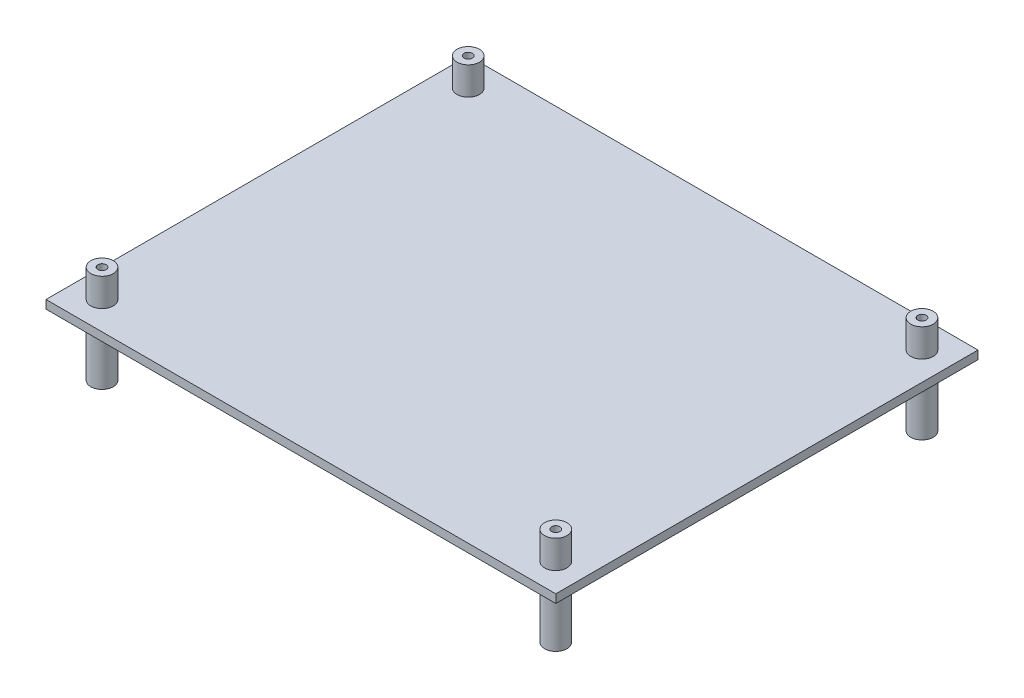
ISO-10303-21;
HEADER;
FILE_DESCRIPTION(('STEP AP214'),'2;1');
FILE_NAME('part.step','',(''),(''),'','','');
FILE_SCHEMA(('AUTOMOTIVE_DESIGN { 1 0 10303 214 1 1 1 1 }'));
ENDSEC;
DATA;
#1=APPLICATION_CONTEXT('core data for automotive mechanical design processes');
#2=APPLICATION_PROTOCOL_DEFINITION('international standard','automotive_design',2000,#1);
#3=PRODUCT_CONTEXT('',#1,'mechanical');
#4=PRODUCT('Part','Part','',(#3));
#5=PRODUCT_RELATED_PRODUCT_CATEGORY('part','',(#4));
#6=PRODUCT_DEFINITION_FORMATION('','',#4);
#7=PRODUCT_DEFINITION_CONTEXT('part definition',#1,'design');
#8=PRODUCT_DEFINITION('design','',#6,#7);
#9=PRODUCT_DEFINITION_SHAPE('','',#8);
#10=(LENGTH_UNIT() NAMED_UNIT(*) SI_UNIT(.MILLI.,.METRE.));
#11=(NAMED_UNIT(*) PLANE_ANGLE_UNIT() SI_UNIT($,.RADIAN.));
#12=(NAMED_UNIT(*) SI_UNIT($,.STERADIAN.) SOLID_ANGLE_UNIT());
#13=UNCERTAINTY_MEASURE_WITH_UNIT(LENGTH_MEASURE(1.E-05),#10,'distance_accuracy_value','');
#14=(GEOMETRIC_REPRESENTATION_CONTEXT(3) GLOBAL_UNCERTAINTY_ASSIGNED_CONTEXT((#13)) GLOBAL_UNIT_ASSIGNED_CONTEXT((#10,
#11,#12)) REPRESENTATION_CONTEXT('',''));
#15=CARTESIAN_POINT('',(0.,0.,0.));
#16=DIRECTION('',(0.,0.,1.));
#17=DIRECTION('',(1.,0.,0.));
#18=AXIS2_PLACEMENT_3D('',#15,#16,#17);
#19=CARTESIAN_POINT('',(0.,3.,0.));
#20=DIRECTION('',(0.,1.,0.));
#21=DIRECTION('',(0.,0.,1.));
#22=AXIS2_PLACEMENT_3D('',#19,#20,#21);
#23=PLANE('',#22);
#24=CARTESIAN_POINT('',(0.,3.,0.));
#25=DIRECTION('',(0.,1.,0.));
#26=DIRECTION('',(0.,0.,1.));
#27=AXIS2_PLACEMENT_3D('',#24,#25,#26);
#28=CIRCLE('',#27,4.);
#29=CARTESIAN_POINT('',(0.,3.,4.));
#30=VERTEX_POINT('',#29);
#31=EDGE_CURVE('E11',#30,#30,#28,.T.);
#32=ORIENTED_EDGE('',*,*,#31,.F.);
#33=EDGE_LOOP('',(#32));
#34=FACE_BOUND('',#33,.T.);
#35=CARTESIAN_POINT('',(162.,3.,0.));
#36=DIRECTION('',(0.,1.,0.));
#37=DIRECTION('',(0.,0.,1.));
#38=AXIS2_PLACEMENT_3D('',#35,#36,#37);
#39=CIRCLE('',#38,3.99999999999999);
#40=CARTESIAN_POINT('',(162.,3.,3.99999999999999));
#41=VERTEX_POINT('',#40);
#42=EDGE_CURVE('E49',#41,#41,#39,.T.);
#43=ORIENTED_EDGE('',*,*,#42,.F.);
#44=EDGE_LOOP('',(#43));
#45=FACE_BOUND('',#44,.T.);
#46=CARTESIAN_POINT('',(162.,3.,-130.75023901));
#47=DIRECTION('',(0.,1.,0.));
#48=DIRECTION('',(0.,0.,1.));
#49=AXIS2_PLACEMENT_3D('',#46,#47,#48);
#50=CIRCLE('',#49,3.99999999999999);
#51=CARTESIAN_POINT('',(162.,3.,-126.75023901));
#52=VERTEX_POINT('',#51);
#53=EDGE_CURVE('E186',#52,#52,#50,.T.);
#54=ORIENTED_EDGE('',*,*,#53,.F.);
#55=EDGE_LOOP('',(#54));
#56=FACE_BOUND('',#55,.T.);
#57=CARTESIAN_POINT('',(0.,3.,-130.75023901));
#58=DIRECTION('',(0.,1.,0.));
#59=DIRECTION('',(0.,0.,1.));
#60=AXIS2_PLACEMENT_3D('',#57,#58,#59);
#61=CIRCLE('',#60,4.);
#62=CARTESIAN_POINT('',(0.,3.,-126.75023901));
#63=VERTEX_POINT('',#62);
#64=EDGE_CURVE('E117',#63,#63,#61,.T.);
#65=ORIENTED_EDGE('',*,*,#64,.F.);
#66=EDGE_LOOP('',(#65));
#67=FACE_BOUND('',#66,.T.);
#68=DIRECTION('',(1.,0.,0.));
#69=VECTOR('',#68,1.);
#70=CARTESIAN_POINT('',(-10.,3.,10.));
#71=LINE('',#70,#69);
#72=CARTESIAN_POINT('',(-10.,3.,10.));
#73=VERTEX_POINT('',#72);
#74=CARTESIAN_POINT('',(172.,3.,10.));
#75=VERTEX_POINT('',#74);
#76=EDGE_CURVE('E93',#73,#75,#71,.T.);
#77=ORIENTED_EDGE('',*,*,#76,.T.);
#78=DIRECTION('',(0.,0.,-1.));
#79=VECTOR('',#78,1.);
#80=CARTESIAN_POINT('',(172.,3.,10.));
#81=LINE('',#80,#79);
#82=CARTESIAN_POINT('',(172.,3.,-140.75023901));
#83=VERTEX_POINT('',#82);
#84=EDGE_CURVE('E89',#75,#83,#81,.T.);
#85=ORIENTED_EDGE('',*,*,#84,.T.);
#86=DIRECTION('',(-1.,0.,0.));
#87=VECTOR('',#86,1.);
#88=CARTESIAN_POINT('',(-10.,3.,-140.75023901));
#89=LINE('',#88,#87);
#90=CARTESIAN_POINT('',(-10.,3.,-140.75023901));
#91=VERTEX_POINT('',#90);
#92=EDGE_CURVE('E91',#83,#91,#89,.T.);
#93=ORIENTED_EDGE('',*,*,#92,.T.);
#94=DIRECTION('',(0.,0.,1.));
#95=VECTOR('',#94,1.);
#96=CARTESIAN_POINT('',(-10.,3.,10.));
#97=LINE('',#96,#95);
#98=EDGE_CURVE('E58',#91,#73,#97,.T.);
#99=ORIENTED_EDGE('',*,*,#98,.T.);
#100=EDGE_LOOP('',(#77,#85,#93,#99));
#101=FACE_BOUND('',#100,.T.);
#102=ADVANCED_FACE('F39',(#34,#45,#56,#67,#101),#23,.T.);
#103=CARTESIAN_POINT('',(0.,0.,0.));
#104=DIRECTION('',(0.,1.,0.));
#105=DIRECTION('',(0.,0.,1.));
#106=AXIS2_PLACEMENT_3D('',#103,#104,#105);
#107=PLANE('',#106);
#108=CARTESIAN_POINT('',(0.,0.,0.));
#109=DIRECTION('',(0.,1.,0.));
#110=DIRECTION('',(0.,0.,1.));
#111=AXIS2_PLACEMENT_3D('',#108,#109,#110);
#112=CIRCLE('',#111,4.);
#113=CARTESIAN_POINT('',(0.,0.,4.));
#114=VERTEX_POINT('',#113);
#115=EDGE_CURVE('E43',#114,#114,#112,.T.);
#116=ORIENTED_EDGE('',*,*,#115,.T.);
#117=EDGE_LOOP('',(#116));
#118=FACE_BOUND('',#117,.T.);
#119=CARTESIAN_POINT('',(162.,0.,0.));
#120=DIRECTION('',(0.,1.,0.));
#121=DIRECTION('',(0.,0.,1.));
#122=AXIS2_PLACEMENT_3D('',#119,#120,#121);
#123=CIRCLE('',#122,3.99999999999999);
#124=CARTESIAN_POINT('',(162.,0.,3.99999999999999));
#125=VERTEX_POINT('',#124);
#126=EDGE_CURVE('E124',#125,#125,#123,.T.);
#127=ORIENTED_EDGE('',*,*,#126,.T.);
#128=EDGE_LOOP('',(#127));
#129=FACE_BOUND('',#128,.T.);
#130=CARTESIAN_POINT('',(162.,0.,-130.75023901));
#131=DIRECTION('',(0.,1.,0.));
#132=DIRECTION('',(0.,0.,1.));
#133=AXIS2_PLACEMENT_3D('',#130,#131,#132);
#134=CIRCLE('',#133,3.99999999999999);
#135=CARTESIAN_POINT('',(162.,0.,-126.75023901));
#136=VERTEX_POINT('',#135);
#137=EDGE_CURVE('E121',#136,#136,#134,.T.);
#138=ORIENTED_EDGE('',*,*,#137,.T.);
#139=EDGE_LOOP('',(#138));
#140=FACE_BOUND('',#139,.T.);
#141=CARTESIAN_POINT('',(0.,0.,-130.75023901));
#142=DIRECTION('',(0.,1.,0.));
#143=DIRECTION('',(0.,0.,1.));
#144=AXIS2_PLACEMENT_3D('',#141,#142,#143);
#145=CIRCLE('',#144,4.);
#146=CARTESIAN_POINT('',(0.,0.,-126.75023901));
#147=VERTEX_POINT('',#146);
#148=EDGE_CURVE('E118',#147,#147,#145,.T.);
#149=ORIENTED_EDGE('',*,*,#148,.T.);
#150=EDGE_LOOP('',(#149));
#151=FACE_BOUND('',#150,.T.);
#152=DIRECTION('',(1.,0.,0.));
#153=VECTOR('',#152,1.);
#154=CARTESIAN_POINT('',(-10.,0.,10.));
#155=LINE('',#154,#153);
#156=CARTESIAN_POINT('',(-10.,0.,10.));
#157=VERTEX_POINT('',#156);
#158=CARTESIAN_POINT('',(172.,0.,10.));
#159=VERTEX_POINT('',#158);
#160=EDGE_CURVE('E108',#157,#159,#155,.T.);
#161=ORIENTED_EDGE('',*,*,#160,.F.);
#162=DIRECTION('',(0.,0.,1.));
#163=VECTOR('',#162,1.);
#164=CARTESIAN_POINT('',(-10.,0.,10.));
#165=LINE('',#164,#163);
#166=CARTESIAN_POINT('',(-10.,0.,-140.75023901));
#167=VERTEX_POINT('',#166);
#168=EDGE_CURVE('E81',#167,#157,#165,.T.);
#169=ORIENTED_EDGE('',*,*,#168,.F.);
#170=DIRECTION('',(-1.,0.,0.));
#171=VECTOR('',#170,1.);
#172=CARTESIAN_POINT('',(-10.,0.,-140.75023901));
#173=LINE('',#172,#171);
#174=CARTESIAN_POINT('',(172.,0.,-140.75023901));
#175=VERTEX_POINT('',#174);
#176=EDGE_CURVE('E75',#175,#167,#173,.T.);
#177=ORIENTED_EDGE('',*,*,#176,.F.);
#178=DIRECTION('',(0.,0.,-1.));
#179=VECTOR('',#178,1.);
#180=CARTESIAN_POINT('',(172.,0.,10.));
#181=LINE('',#180,#179);
#182=EDGE_CURVE('E98',#159,#175,#181,.T.);
#183=ORIENTED_EDGE('',*,*,#182,.F.);
#184=EDGE_LOOP('',(#161,#169,#177,#183));
#185=FACE_BOUND('',#184,.T.);
#186=ADVANCED_FACE('F131',(#118,#129,#140,#151,#185),#107,.F.);
#187=CARTESIAN_POINT('',(-10.,3.,10.));
#188=DIRECTION('',(0.,0.,-1.));
#189=DIRECTION('',(-1.,0.,0.));
#190=AXIS2_PLACEMENT_3D('',#187,#188,#189);
#191=PLANE('',#190);
#192=ORIENTED_EDGE('',*,*,#160,.T.);
#193=DIRECTION('',(0.,-1.,0.));
#194=VECTOR('',#193,1.);
#195=CARTESIAN_POINT('',(172.,3.,10.));
#196=LINE('',#195,#194);
#197=EDGE_CURVE('E99',#75,#159,#196,.T.);
#198=ORIENTED_EDGE('',*,*,#197,.F.);
#199=ORIENTED_EDGE('',*,*,#76,.F.);
#200=DIRECTION('',(0.,-1.,0.));
#201=VECTOR('',#200,1.);
#202=CARTESIAN_POINT('',(-10.,3.,10.));
#203=LINE('',#202,#201);
#204=EDGE_CURVE('E104',#73,#157,#203,.T.);
#205=ORIENTED_EDGE('',*,*,#204,.T.);
#206=EDGE_LOOP('',(#192,#198,#199,#205));
#207=FACE_BOUND('',#206,.T.);
#208=ADVANCED_FACE('F41',(#207),#191,.F.);
#209=CARTESIAN_POINT('',(172.,3.,10.));
#210=DIRECTION('',(-1.,0.,0.));
#211=DIRECTION('',(0.,0.,1.));
#212=AXIS2_PLACEMENT_3D('',#209,#210,#211);
#213=PLANE('',#212);
#214=ORIENTED_EDGE('',*,*,#182,.T.);
#215=DIRECTION('',(0.,-1.,0.));
#216=VECTOR('',#215,1.);
#217=CARTESIAN_POINT('',(172.,3.,-140.75023901));
#218=LINE('',#217,#216);
#219=EDGE_CURVE('E96',#83,#175,#218,.T.);
#220=ORIENTED_EDGE('',*,*,#219,.F.);
#221=ORIENTED_EDGE('',*,*,#84,.F.);
#222=ORIENTED_EDGE('',*,*,#197,.T.);
#223=EDGE_LOOP('',(#214,#220,#221,#222));
#224=FACE_BOUND('',#223,.T.);
#225=ADVANCED_FACE('F97',(#224),#213,.F.);
#226=CARTESIAN_POINT('',(-10.,3.,-140.75023901));
#227=DIRECTION('',(0.,0.,1.));
#228=DIRECTION('',(1.,0.,0.));
#229=AXIS2_PLACEMENT_3D('',#226,#227,#228);
#230=PLANE('',#229);
#231=ORIENTED_EDGE('',*,*,#176,.T.);
#232=DIRECTION('',(0.,-1.,0.));
#233=VECTOR('',#232,1.);
#234=CARTESIAN_POINT('',(-10.,3.,-140.75023901));
#235=LINE('',#234,#233);
#236=EDGE_CURVE('E100',#91,#167,#235,.T.);
#237=ORIENTED_EDGE('',*,*,#236,.F.);
#238=ORIENTED_EDGE('',*,*,#92,.F.);
#239=ORIENTED_EDGE('',*,*,#219,.T.);
#240=EDGE_LOOP('',(#231,#237,#238,#239));
#241=FACE_BOUND('',#240,.T.);
#242=ADVANCED_FACE('F102',(#241),#230,.F.);
#243=CARTESIAN_POINT('',(-10.,3.,10.));
#244=DIRECTION('',(1.,0.,0.));
#245=DIRECTION('',(0.,0.,-1.));
#246=AXIS2_PLACEMENT_3D('',#243,#244,#245);
#247=PLANE('',#246);
#248=ORIENTED_EDGE('',*,*,#168,.T.);
#249=ORIENTED_EDGE('',*,*,#204,.F.);
#250=ORIENTED_EDGE('',*,*,#98,.F.);
#251=ORIENTED_EDGE('',*,*,#236,.T.);
#252=EDGE_LOOP('',(#248,#249,#250,#251));
#253=FACE_BOUND('',#252,.T.);
#254=ADVANCED_FACE('F170',(#253),#247,.F.);
#255=CARTESIAN_POINT('',(0.,-22.,-130.75023901));
#256=DIRECTION('',(0.,1.,0.));
#257=DIRECTION('',(0.,0.,1.));
#258=AXIS2_PLACEMENT_3D('',#255,#256,#257);
#259=CYLINDRICAL_SURFACE('',#258,4.);
#260=CARTESIAN_POINT('',(0.,-22.,-130.75023901));
#261=DIRECTION('',(0.,1.,0.));
#262=DIRECTION('',(0.,0.,1.));
#263=AXIS2_PLACEMENT_3D('',#260,#261,#262);
#264=CIRCLE('',#263,4.);
#265=CARTESIAN_POINT('',(0.,-22.,-126.75023901));
#266=VERTEX_POINT('',#265);
#267=EDGE_CURVE('E122',#266,#266,#264,.T.);
#268=ORIENTED_EDGE('',*,*,#267,.T.);
#269=EDGE_LOOP('',(#268));
#270=FACE_BOUND('',#269,.T.);
#271=ORIENTED_EDGE('',*,*,#148,.F.);
#272=EDGE_LOOP('',(#271));
#273=FACE_BOUND('',#272,.T.);
#274=ADVANCED_FACE('F172',(#270,#273),#259,.T.);
#275=CARTESIAN_POINT('',(0.,-22.,-130.75023901));
#276=DIRECTION('',(0.,1.,0.));
#277=DIRECTION('',(0.,0.,1.));
#278=AXIS2_PLACEMENT_3D('',#275,#276,#277);
#279=PLANE('',#278);
#280=CARTESIAN_POINT('',(0.,-22.,-130.75023901));
#281=DIRECTION('',(0.,1.,0.));
#282=DIRECTION('',(0.,0.,1.));
#283=AXIS2_PLACEMENT_3D('',#280,#281,#282);
#284=CIRCLE('',#283,1.5);
#285=CARTESIAN_POINT('',(0.,-22.,-129.25023901));
#286=VERTEX_POINT('',#285);
#287=EDGE_CURVE('E193',#286,#286,#284,.T.);
#288=ORIENTED_EDGE('',*,*,#287,.T.);
#289=EDGE_LOOP('',(#288));
#290=FACE_BOUND('',#289,.T.);
#291=ORIENTED_EDGE('',*,*,#267,.F.);
#292=EDGE_LOOP('',(#291));
#293=FACE_BOUND('',#292,.T.);
#294=ADVANCED_FACE('F364',(#290,#293),#279,.F.);
#295=CARTESIAN_POINT('',(0.,3.,-130.75023901));
#296=DIRECTION('',(0.,-1.,0.));
#297=DIRECTION('',(0.,0.,-1.));
#298=AXIS2_PLACEMENT_3D('',#295,#296,#297);
#299=CYLINDRICAL_SURFACE('',#298,1.5);
#300=ORIENTED_EDGE('',*,*,#287,.F.);
#301=EDGE_LOOP('',(#300));
#302=FACE_BOUND('',#301,.T.);
#303=CARTESIAN_POINT('',(0.,13.,-130.75023901));
#304=DIRECTION('',(0.,1.,0.));
#305=DIRECTION('',(0.,0.,1.));
#306=AXIS2_PLACEMENT_3D('',#303,#304,#305);
#307=CIRCLE('',#306,1.5);
#308=CARTESIAN_POINT('',(0.,13.,-129.25023901));
#309=VERTEX_POINT('',#308);
#310=EDGE_CURVE('E199',#309,#309,#307,.T.);
#311=ORIENTED_EDGE('',*,*,#310,.T.);
#312=EDGE_LOOP('',(#311));
#313=FACE_BOUND('',#312,.T.);
#314=ADVANCED_FACE('F167',(#302,#313),#299,.F.);
#315=CARTESIAN_POINT('',(162.,-22.,-130.75023901));
#316=DIRECTION('',(0.,1.,0.));
#317=DIRECTION('',(0.,0.,1.));
#318=AXIS2_PLACEMENT_3D('',#315,#316,#317);
#319=CYLINDRICAL_SURFACE('',#318,3.99999999999999);
#320=CARTESIAN_POINT('',(162.,-22.,-130.75023901));
#321=DIRECTION('',(0.,1.,0.));
#322=DIRECTION('',(0.,0.,1.));
#323=AXIS2_PLACEMENT_3D('',#320,#321,#322);
#324=CIRCLE('',#323,3.99999999999999);
#325=CARTESIAN_POINT('',(162.,-22.,-126.75023901));
#326=VERTEX_POINT('',#325);
#327=EDGE_CURVE('E218',#326,#326,#324,.T.);
#328=ORIENTED_EDGE('',*,*,#327,.T.);
#329=EDGE_LOOP('',(#328));
#330=FACE_BOUND('',#329,.T.);
#331=ORIENTED_EDGE('',*,*,#137,.F.);
#332=EDGE_LOOP('',(#331));
#333=FACE_BOUND('',#332,.T.);
#334=ADVANCED_FACE('F238',(#330,#333),#319,.T.);
#335=CARTESIAN_POINT('',(162.,-22.,-130.75023901));
#336=DIRECTION('',(0.,1.,0.));
#337=DIRECTION('',(0.,0.,1.));
#338=AXIS2_PLACEMENT_3D('',#335,#336,#337);
#339=PLANE('',#338);
#340=CARTESIAN_POINT('',(162.,-22.,-130.75023901));
#341=DIRECTION('',(0.,1.,0.));
#342=DIRECTION('',(0.,0.,1.));
#343=AXIS2_PLACEMENT_3D('',#340,#341,#342);
#344=CIRCLE('',#343,1.5);
#345=CARTESIAN_POINT('',(162.,-22.,-129.25023901));
#346=VERTEX_POINT('',#345);
#347=EDGE_CURVE('E232',#346,#346,#344,.T.);
#348=ORIENTED_EDGE('',*,*,#347,.T.);
#349=EDGE_LOOP('',(#348));
#350=FACE_BOUND('',#349,.T.);
#351=ORIENTED_EDGE('',*,*,#327,.F.);
#352=EDGE_LOOP('',(#351));
#353=FACE_BOUND('',#352,.T.);
#354=ADVANCED_FACE('F241',(#350,#353),#339,.F.);
#355=CARTESIAN_POINT('',(162.,3.,-130.75023901));
#356=DIRECTION('',(0.,-1.,0.));
#357=DIRECTION('',(0.,0.,-1.));
#358=AXIS2_PLACEMENT_3D('',#355,#356,#357);
#359=CYLINDRICAL_SURFACE('',#358,1.5);
#360=ORIENTED_EDGE('',*,*,#347,.F.);
#361=EDGE_LOOP('',(#360));
#362=FACE_BOUND('',#361,.T.);
#363=CARTESIAN_POINT('',(162.,13.,-130.75023901));
#364=DIRECTION('',(0.,1.,0.));
#365=DIRECTION('',(0.,0.,1.));
#366=AXIS2_PLACEMENT_3D('',#363,#364,#365);
#367=CIRCLE('',#366,1.5);
#368=CARTESIAN_POINT('',(162.,13.,-129.25023901));
#369=VERTEX_POINT('',#368);
#370=EDGE_CURVE('E202',#369,#369,#367,.T.);
#371=ORIENTED_EDGE('',*,*,#370,.T.);
#372=EDGE_LOOP('',(#371));
#373=FACE_BOUND('',#372,.T.);
#374=ADVANCED_FACE('F243',(#362,#373),#359,.F.);
#375=CARTESIAN_POINT('',(162.,-22.,0.));
#376=DIRECTION('',(0.,1.,0.));
#377=DIRECTION('',(0.,0.,1.));
#378=AXIS2_PLACEMENT_3D('',#375,#376,#377);
#379=CYLINDRICAL_SURFACE('',#378,3.99999999999999);
#380=CARTESIAN_POINT('',(162.,-22.,0.));
#381=DIRECTION('',(0.,1.,0.));
#382=DIRECTION('',(0.,0.,1.));
#383=AXIS2_PLACEMENT_3D('',#380,#381,#382);
#384=CIRCLE('',#383,3.99999999999999);
#385=CARTESIAN_POINT('',(162.,-22.,3.99999999999999));
#386=VERTEX_POINT('',#385);
#387=EDGE_CURVE('E206',#386,#386,#384,.T.);
#388=ORIENTED_EDGE('',*,*,#387,.T.);
#389=EDGE_LOOP('',(#388));
#390=FACE_BOUND('',#389,.T.);
#391=ORIENTED_EDGE('',*,*,#126,.F.);
#392=EDGE_LOOP('',(#391));
#393=FACE_BOUND('',#392,.T.);
#394=ADVANCED_FACE('F250',(#390,#393),#379,.T.);
#395=CARTESIAN_POINT('',(162.,-22.,0.));
#396=DIRECTION('',(0.,1.,0.));
#397=DIRECTION('',(0.,0.,1.));
#398=AXIS2_PLACEMENT_3D('',#395,#396,#397);
#399=PLANE('',#398);
#400=CARTESIAN_POINT('',(162.,-22.,0.));
#401=DIRECTION('',(0.,1.,0.));
#402=DIRECTION('',(0.,0.,1.));
#403=AXIS2_PLACEMENT_3D('',#400,#401,#402);
#404=CIRCLE('',#403,1.5);
#405=CARTESIAN_POINT('',(162.,-22.,1.5));
#406=VERTEX_POINT('',#405);
#407=EDGE_CURVE('E222',#406,#406,#404,.T.);
#408=ORIENTED_EDGE('',*,*,#407,.T.);
#409=EDGE_LOOP('',(#408));
#410=FACE_BOUND('',#409,.T.);
#411=ORIENTED_EDGE('',*,*,#387,.F.);
#412=EDGE_LOOP('',(#411));
#413=FACE_BOUND('',#412,.T.);
#414=ADVANCED_FACE('F147',(#410,#413),#399,.F.);
#415=CARTESIAN_POINT('',(162.,3.,0.));
#416=DIRECTION('',(0.,-1.,0.));
#417=DIRECTION('',(0.,0.,-1.));
#418=AXIS2_PLACEMENT_3D('',#415,#416,#417);
#419=CYLINDRICAL_SURFACE('',#418,1.5);
#420=ORIENTED_EDGE('',*,*,#407,.F.);
#421=EDGE_LOOP('',(#420));
#422=FACE_BOUND('',#421,.T.);
#423=CARTESIAN_POINT('',(162.,13.,0.));
#424=DIRECTION('',(0.,1.,0.));
#425=DIRECTION('',(0.,0.,1.));
#426=AXIS2_PLACEMENT_3D('',#423,#424,#425);
#427=CIRCLE('',#426,1.5);
#428=CARTESIAN_POINT('',(162.,13.,1.5));
#429=VERTEX_POINT('',#428);
#430=EDGE_CURVE('E215',#429,#429,#427,.T.);
#431=ORIENTED_EDGE('',*,*,#430,.T.);
#432=EDGE_LOOP('',(#431));
#433=FACE_BOUND('',#432,.T.);
#434=ADVANCED_FACE('F136',(#422,#433),#419,.F.);
#435=CARTESIAN_POINT('',(0.,-22.,0.));
#436=DIRECTION('',(0.,1.,0.));
#437=DIRECTION('',(0.,0.,1.));
#438=AXIS2_PLACEMENT_3D('',#435,#436,#437);
#439=CYLINDRICAL_SURFACE('',#438,4.);
#440=CARTESIAN_POINT('',(0.,-22.,0.));
#441=DIRECTION('',(0.,1.,0.));
#442=DIRECTION('',(0.,0.,1.));
#443=AXIS2_PLACEMENT_3D('',#440,#441,#442);
#444=CIRCLE('',#443,4.);
#445=CARTESIAN_POINT('',(0.,-22.,4.));
#446=VERTEX_POINT('',#445);
#447=EDGE_CURVE('E213',#446,#446,#444,.T.);
#448=ORIENTED_EDGE('',*,*,#447,.T.);
#449=EDGE_LOOP('',(#448));
#450=FACE_BOUND('',#449,.T.);
#451=ORIENTED_EDGE('',*,*,#115,.F.);
#452=EDGE_LOOP('',(#451));
#453=FACE_BOUND('',#452,.T.);
#454=ADVANCED_FACE('F133',(#450,#453),#439,.T.);
#455=CARTESIAN_POINT('',(0.,-22.,0.));
#456=DIRECTION('',(0.,1.,0.));
#457=DIRECTION('',(0.,0.,1.));
#458=AXIS2_PLACEMENT_3D('',#455,#456,#457);
#459=PLANE('',#458);
#460=CARTESIAN_POINT('',(0.,-22.,0.));
#461=DIRECTION('',(0.,1.,0.));
#462=DIRECTION('',(0.,0.,1.));
#463=AXIS2_PLACEMENT_3D('',#460,#461,#462);
#464=CIRCLE('',#463,1.5);
#465=CARTESIAN_POINT('',(0.,-22.,1.5));
#466=VERTEX_POINT('',#465);
#467=EDGE_CURVE('E210',#466,#466,#464,.T.);
#468=ORIENTED_EDGE('',*,*,#467,.T.);
#469=EDGE_LOOP('',(#468));
#470=FACE_BOUND('',#469,.T.);
#471=ORIENTED_EDGE('',*,*,#447,.F.);
#472=EDGE_LOOP('',(#471));
#473=FACE_BOUND('',#472,.T.);
#474=ADVANCED_FACE('F135',(#470,#473),#459,.F.);
#475=CARTESIAN_POINT('',(0.,3.,0.));
#476=DIRECTION('',(0.,-1.,0.));
#477=DIRECTION('',(0.,0.,-1.));
#478=AXIS2_PLACEMENT_3D('',#475,#476,#477);
#479=CYLINDRICAL_SURFACE('',#478,1.5);
#480=ORIENTED_EDGE('',*,*,#467,.F.);
#481=EDGE_LOOP('',(#480));
#482=FACE_BOUND('',#481,.T.);
#483=CARTESIAN_POINT('',(0.,13.,0.));
#484=DIRECTION('',(0.,1.,0.));
#485=DIRECTION('',(0.,0.,1.));
#486=AXIS2_PLACEMENT_3D('',#483,#484,#485);
#487=CIRCLE('',#486,1.5);
#488=CARTESIAN_POINT('',(0.,13.,1.5));
#489=VERTEX_POINT('',#488);
#490=EDGE_CURVE('E203',#489,#489,#487,.T.);
#491=ORIENTED_EDGE('',*,*,#490,.T.);
#492=EDGE_LOOP('',(#491));
#493=FACE_BOUND('',#492,.T.);
#494=ADVANCED_FACE('F144',(#482,#493),#479,.F.);
#495=ORIENTED_EDGE('',*,*,#64,.T.);
#496=EDGE_LOOP('',(#495));
#497=FACE_BOUND('',#496,.T.);
#498=CARTESIAN_POINT('',(0.,13.,-130.75023901));
#499=DIRECTION('',(0.,1.,0.));
#500=DIRECTION('',(0.,0.,1.));
#501=AXIS2_PLACEMENT_3D('',#498,#499,#500);
#502=CIRCLE('',#501,4.);
#503=CARTESIAN_POINT('',(0.,13.,-126.75023901));
#504=VERTEX_POINT('',#503);
#505=EDGE_CURVE('E196',#504,#504,#502,.T.);
#506=ORIENTED_EDGE('',*,*,#505,.F.);
#507=EDGE_LOOP('',(#506));
#508=FACE_BOUND('',#507,.T.);
#509=ADVANCED_FACE('F317',(#497,#508),#259,.T.);
#510=CARTESIAN_POINT('',(0.,13.,-130.75023901));
#511=DIRECTION('',(0.,1.,0.));
#512=DIRECTION('',(0.,0.,1.));
#513=AXIS2_PLACEMENT_3D('',#510,#511,#512);
#514=PLANE('',#513);
#515=ORIENTED_EDGE('',*,*,#505,.T.);
#516=EDGE_LOOP('',(#515));
#517=FACE_BOUND('',#516,.T.);
#518=ORIENTED_EDGE('',*,*,#310,.F.);
#519=EDGE_LOOP('',(#518));
#520=FACE_BOUND('',#519,.T.);
#521=ADVANCED_FACE('F309',(#517,#520),#514,.T.);
#522=ORIENTED_EDGE('',*,*,#53,.T.);
#523=EDGE_LOOP('',(#522));
#524=FACE_BOUND('',#523,.T.);
#525=CARTESIAN_POINT('',(162.,13.,-130.75023901));
#526=DIRECTION('',(0.,1.,0.));
#527=DIRECTION('',(0.,0.,1.));
#528=AXIS2_PLACEMENT_3D('',#525,#526,#527);
#529=CIRCLE('',#528,3.99999999999999);
#530=CARTESIAN_POINT('',(162.,13.,-126.75023901));
#531=VERTEX_POINT('',#530);
#532=EDGE_CURVE('E229',#531,#531,#529,.T.);
#533=ORIENTED_EDGE('',*,*,#532,.F.);
#534=EDGE_LOOP('',(#533));
#535=FACE_BOUND('',#534,.T.);
#536=ADVANCED_FACE('F253',(#524,#535),#319,.T.);
#537=CARTESIAN_POINT('',(162.,13.,-130.75023901));
#538=DIRECTION('',(0.,1.,0.));
#539=DIRECTION('',(0.,0.,1.));
#540=AXIS2_PLACEMENT_3D('',#537,#538,#539);
#541=PLANE('',#540);
#542=ORIENTED_EDGE('',*,*,#532,.T.);
#543=EDGE_LOOP('',(#542));
#544=FACE_BOUND('',#543,.T.);
#545=ORIENTED_EDGE('',*,*,#370,.F.);
#546=EDGE_LOOP('',(#545));
#547=FACE_BOUND('',#546,.T.);
#548=ADVANCED_FACE('F255',(#544,#547),#541,.T.);
#549=ORIENTED_EDGE('',*,*,#42,.T.);
#550=EDGE_LOOP('',(#549));
#551=FACE_BOUND('',#550,.T.);
#552=CARTESIAN_POINT('',(162.,13.,0.));
#553=DIRECTION('',(0.,1.,0.));
#554=DIRECTION('',(0.,0.,1.));
#555=AXIS2_PLACEMENT_3D('',#552,#553,#554);
#556=CIRCLE('',#555,3.99999999999999);
#557=CARTESIAN_POINT('',(162.,13.,3.99999999999999));
#558=VERTEX_POINT('',#557);
#559=EDGE_CURVE('E219',#558,#558,#556,.T.);
#560=ORIENTED_EDGE('',*,*,#559,.F.);
#561=EDGE_LOOP('',(#560));
#562=FACE_BOUND('',#561,.T.);
#563=ADVANCED_FACE('F258',(#551,#562),#379,.T.);
#564=CARTESIAN_POINT('',(162.,13.,0.));
#565=DIRECTION('',(0.,1.,0.));
#566=DIRECTION('',(0.,0.,1.));
#567=AXIS2_PLACEMENT_3D('',#564,#565,#566);
#568=PLANE('',#567);
#569=ORIENTED_EDGE('',*,*,#559,.T.);
#570=EDGE_LOOP('',(#569));
#571=FACE_BOUND('',#570,.T.);
#572=ORIENTED_EDGE('',*,*,#430,.F.);
#573=EDGE_LOOP('',(#572));
#574=FACE_BOUND('',#573,.T.);
#575=ADVANCED_FACE('F154',(#571,#574),#568,.T.);
#576=ORIENTED_EDGE('',*,*,#31,.T.);
#577=EDGE_LOOP('',(#576));
#578=FACE_BOUND('',#577,.T.);
#579=CARTESIAN_POINT('',(0.,13.,0.));
#580=DIRECTION('',(0.,1.,0.));
#581=DIRECTION('',(0.,0.,1.));
#582=AXIS2_PLACEMENT_3D('',#579,#580,#581);
#583=CIRCLE('',#582,4.);
#584=CARTESIAN_POINT('',(0.,13.,4.));
#585=VERTEX_POINT('',#584);
#586=EDGE_CURVE('E207',#585,#585,#583,.T.);
#587=ORIENTED_EDGE('',*,*,#586,.F.);
#588=EDGE_LOOP('',(#587));
#589=FACE_BOUND('',#588,.T.);
#590=ADVANCED_FACE('F139',(#578,#589),#439,.T.);
#591=CARTESIAN_POINT('',(0.,13.,0.));
#592=DIRECTION('',(0.,1.,0.));
#593=DIRECTION('',(0.,0.,1.));
#594=AXIS2_PLACEMENT_3D('',#591,#592,#593);
#595=PLANE('',#594);
#596=ORIENTED_EDGE('',*,*,#586,.T.);
#597=EDGE_LOOP('',(#596));
#598=FACE_BOUND('',#597,.T.);
#599=ORIENTED_EDGE('',*,*,#490,.F.);
#600=EDGE_LOOP('',(#599));
#601=FACE_BOUND('',#600,.T.);
#602=ADVANCED_FACE('F153',(#598,#601),#595,.T.);
#603=CLOSED_SHELL('',(#102,#186,#208,#225,#242,#254,#274,#294,#314,#334,#354,#374,#394,#414,
#434,#454,#474,#494,#509,#521,#536,#548,#563,#575,#590,#602));
#604=MANIFOLD_SOLID_BREP('B2',#603);
#605=ADVANCED_BREP_SHAPE_REPRESENTATION('',(#18,#604),#14);
#606=SHAPE_DEFINITION_REPRESENTATION(#9,#605);
ENDSEC;
END-ISO-10303-21;
